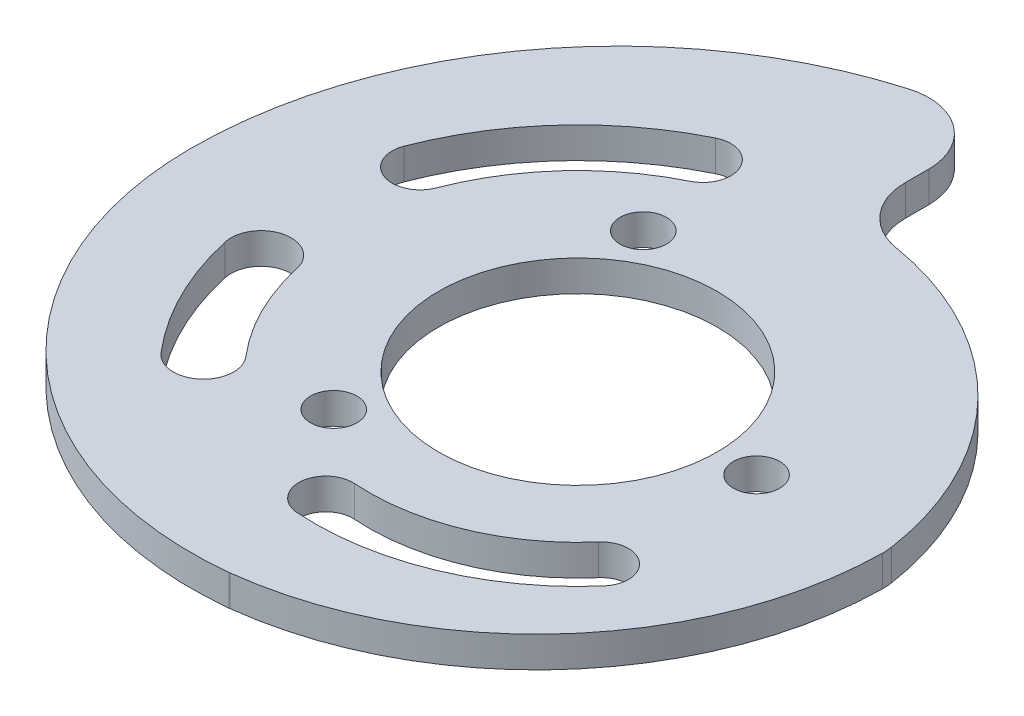
ISO-10303-21;
HEADER;
FILE_DESCRIPTION(('STEP AP214'),'2;1');
FILE_NAME('part.step','',(''),(''),'','','');
FILE_SCHEMA(('AUTOMOTIVE_DESIGN { 1 0 10303 214 1 1 1 1 }'));
ENDSEC;
DATA;
#1=APPLICATION_CONTEXT('core data for automotive mechanical design processes');
#2=APPLICATION_PROTOCOL_DEFINITION('international standard','automotive_design',2000,#1);
#3=PRODUCT_CONTEXT('',#1,'mechanical');
#4=PRODUCT('Part','Part','',(#3));
#5=PRODUCT_RELATED_PRODUCT_CATEGORY('part','',(#4));
#6=PRODUCT_DEFINITION_FORMATION('','',#4);
#7=PRODUCT_DEFINITION_CONTEXT('part definition',#1,'design');
#8=PRODUCT_DEFINITION('design','',#6,#7);
#9=PRODUCT_DEFINITION_SHAPE('','',#8);
#10=(LENGTH_UNIT() NAMED_UNIT(*) SI_UNIT(.MILLI.,.METRE.));
#11=(NAMED_UNIT(*) PLANE_ANGLE_UNIT() SI_UNIT($,.RADIAN.));
#12=(NAMED_UNIT(*) SI_UNIT($,.STERADIAN.) SOLID_ANGLE_UNIT());
#13=UNCERTAINTY_MEASURE_WITH_UNIT(LENGTH_MEASURE(1.E-05),#10,'distance_accuracy_value','');
#14=(GEOMETRIC_REPRESENTATION_CONTEXT(3) GLOBAL_UNCERTAINTY_ASSIGNED_CONTEXT((#13)) GLOBAL_UNIT_ASSIGNED_CONTEXT((#10,
#11,#12)) REPRESENTATION_CONTEXT('',''));
#15=CARTESIAN_POINT('',(0.,0.,0.));
#16=DIRECTION('',(0.,0.,1.));
#17=DIRECTION('',(1.,0.,0.));
#18=AXIS2_PLACEMENT_3D('',#15,#16,#17);
#19=CARTESIAN_POINT('',(2.62500000000001,2.,0.));
#20=DIRECTION('',(0.,-1.,0.));
#21=DIRECTION('',(0.,0.,-1.));
#22=AXIS2_PLACEMENT_3D('',#19,#20,#21);
#23=CYLINDRICAL_SURFACE('',#22,27.625);
#24=CARTESIAN_POINT('',(2.62500000000001,2.,0.));
#25=DIRECTION('',(0.,1.,0.));
#26=DIRECTION('',(0.,0.,1.));
#27=AXIS2_PLACEMENT_3D('',#24,#25,#26);
#28=CIRCLE('',#27,27.625);
#29=CARTESIAN_POINT('',(-5.12169312169312,2.,-26.5165867086681));
#30=VERTEX_POINT('',#29);
#31=CARTESIAN_POINT('',(-25.,2.,0.));
#32=VERTEX_POINT('',#31);
#33=EDGE_CURVE('E303',#30,#32,#28,.T.);
#34=ORIENTED_EDGE('',*,*,#33,.F.);
#35=DIRECTION('',(0.,-1.,0.));
#36=VECTOR('',#35,1.);
#37=CARTESIAN_POINT('',(-5.12169312169312,2.,-26.5165867086681));
#38=LINE('',#37,#36);
#39=CARTESIAN_POINT('',(-5.12169312169312,0.,-26.5165867086681));
#40=VERTEX_POINT('',#39);
#41=EDGE_CURVE('E362',#30,#40,#38,.T.);
#42=ORIENTED_EDGE('',*,*,#41,.T.);
#43=CARTESIAN_POINT('',(2.62500000000001,0.,0.));
#44=DIRECTION('',(0.,1.,0.));
#45=DIRECTION('',(0.,0.,1.));
#46=AXIS2_PLACEMENT_3D('',#43,#44,#45);
#47=CIRCLE('',#46,27.625);
#48=CARTESIAN_POINT('',(-25.,0.,0.));
#49=VERTEX_POINT('',#48);
#50=EDGE_CURVE('E300',#40,#49,#47,.T.);
#51=ORIENTED_EDGE('',*,*,#50,.T.);
#52=DIRECTION('',(0.,-1.,0.));
#53=VECTOR('',#52,1.);
#54=CARTESIAN_POINT('',(-25.,2.,0.));
#55=LINE('',#54,#53);
#56=EDGE_CURVE('E318',#32,#49,#55,.T.);
#57=ORIENTED_EDGE('',*,*,#56,.F.);
#58=EDGE_LOOP('',(#34,#42,#51,#57));
#59=FACE_BOUND('',#58,.T.);
#60=ADVANCED_FACE('F35',(#59),#23,.T.);
#61=CARTESIAN_POINT('',(-2.37500000000001,2.,0.));
#62=DIRECTION('',(0.,-1.,0.));
#63=DIRECTION('',(0.,0.,-1.));
#64=AXIS2_PLACEMENT_3D('',#61,#62,#63);
#65=CYLINDRICAL_SURFACE('',#64,22.625);
#66=CARTESIAN_POINT('',(-2.37500000000001,0.,0.));
#67=DIRECTION('',(0.,1.,0.));
#68=DIRECTION('',(0.,0.,1.));
#69=AXIS2_PLACEMENT_3D('',#66,#67,#68);
#70=CIRCLE('',#69,22.625);
#71=CARTESIAN_POINT('',(-0.029828486204325,0.,22.5031285729536));
#72=VERTEX_POINT('',#71);
#73=EDGE_CURVE('E320',#49,#72,#70,.T.);
#74=ORIENTED_EDGE('',*,*,#73,.T.);
#75=DIRECTION('',(0.,-1.,0.));
#76=VECTOR('',#75,1.);
#77=CARTESIAN_POINT('',(-0.0298284862043246,2.,22.5031285729536));
#78=LINE('',#77,#76);
#79=CARTESIAN_POINT('',(-0.029828486204325,2.,22.5031285729536));
#80=VERTEX_POINT('',#79);
#81=EDGE_CURVE('E344',#72,#80,#78,.F.);
#82=ORIENTED_EDGE('',*,*,#81,.T.);
#83=CARTESIAN_POINT('',(-2.37500000000001,2.,0.));
#84=DIRECTION('',(0.,1.,0.));
#85=DIRECTION('',(0.,0.,1.));
#86=AXIS2_PLACEMENT_3D('',#83,#84,#85);
#87=CIRCLE('',#86,22.625);
#88=EDGE_CURVE('E305',#32,#80,#87,.T.);
#89=ORIENTED_EDGE('',*,*,#88,.F.);
#90=ORIENTED_EDGE('',*,*,#56,.T.);
#91=EDGE_LOOP('',(#74,#82,#89,#90));
#92=FACE_BOUND('',#91,.T.);
#93=ADVANCED_FACE('F393',(#92),#65,.T.);
#94=CARTESIAN_POINT('',(-2.65625000000001,2.,0.));
#95=DIRECTION('',(0.,-1.,0.));
#96=DIRECTION('',(0.,0.,-1.));
#97=AXIS2_PLACEMENT_3D('',#94,#95,#96);
#98=CYLINDRICAL_SURFACE('',#97,22.65625);
#99=CARTESIAN_POINT('',(-2.65625000000001,2.,0.));
#100=DIRECTION('',(0.,1.,0.));
#101=DIRECTION('',(0.,0.,1.));
#102=AXIS2_PLACEMENT_3D('',#99,#100,#101);
#103=CIRCLE('',#102,22.65625);
#104=CARTESIAN_POINT('',(0.0297785222408337,2.,22.4964644964539));
#105=VERTEX_POINT('',#104);
#106=CARTESIAN_POINT('',(19.9976520326362,2.,0.326169830338211));
#107=VERTEX_POINT('',#106);
#108=EDGE_CURVE('E309',#105,#107,#103,.T.);
#109=ORIENTED_EDGE('',*,*,#108,.F.);
#110=DIRECTION('',(0.,-1.,0.));
#111=VECTOR('',#110,1.);
#112=CARTESIAN_POINT('',(0.0297785222408337,2.,22.4964644964539));
#113=LINE('',#112,#111);
#114=CARTESIAN_POINT('',(0.0297785222408337,0.,22.4964644964539));
#115=VERTEX_POINT('',#114);
#116=EDGE_CURVE('E335',#105,#115,#113,.T.);
#117=ORIENTED_EDGE('',*,*,#116,.T.);
#118=CARTESIAN_POINT('',(-2.65625000000001,0.,0.));
#119=DIRECTION('',(0.,1.,0.));
#120=DIRECTION('',(0.,0.,1.));
#121=AXIS2_PLACEMENT_3D('',#118,#119,#120);
#122=CIRCLE('',#121,22.65625);
#123=CARTESIAN_POINT('',(19.9976520326362,0.,0.326169830338211));
#124=VERTEX_POINT('',#123);
#125=EDGE_CURVE('E323',#115,#124,#122,.T.);
#126=ORIENTED_EDGE('',*,*,#125,.T.);
#127=DIRECTION('',(0.,-1.,0.));
#128=VECTOR('',#127,1.);
#129=CARTESIAN_POINT('',(19.9976520326362,2.,0.326169830338211));
#130=LINE('',#129,#128);
#131=EDGE_CURVE('E333',#124,#107,#130,.F.);
#132=ORIENTED_EDGE('',*,*,#131,.T.);
#133=EDGE_LOOP('',(#109,#117,#126,#132));
#134=FACE_BOUND('',#133,.T.);
#135=ADVANCED_FACE('F401',(#134),#98,.T.);
#136=CARTESIAN_POINT('',(0.,2.,2.67857142857143));
#137=DIRECTION('',(0.,-1.,0.));
#138=DIRECTION('',(0.,0.,-1.));
#139=AXIS2_PLACEMENT_3D('',#136,#137,#138);
#140=CYLINDRICAL_SURFACE('',#139,20.1785714285714);
#141=CARTESIAN_POINT('',(0.,2.,2.67857142857143));
#142=DIRECTION('',(0.,1.,0.));
#143=DIRECTION('',(0.,0.,1.));
#144=AXIS2_PLACEMENT_3D('',#141,#142,#143);
#145=CIRCLE('',#144,20.1785714285714);
#146=CARTESIAN_POINT('',(19.9534384375987,2.,-0.327262800876213));
#147=VERTEX_POINT('',#146);
#148=CARTESIAN_POINT('',(3.33825701624816,2.,-17.2219508005418));
#149=VERTEX_POINT('',#148);
#150=EDGE_CURVE('E312',#147,#149,#145,.T.);
#151=ORIENTED_EDGE('',*,*,#150,.F.);
#152=DIRECTION('',(0.,-1.,0.));
#153=VECTOR('',#152,1.);
#154=CARTESIAN_POINT('',(19.9534384375987,2.,-0.327262800876212));
#155=LINE('',#154,#153);
#156=CARTESIAN_POINT('',(19.9534384375987,0.,-0.327262800876213));
#157=VERTEX_POINT('',#156);
#158=EDGE_CURVE('E354',#147,#157,#155,.T.);
#159=ORIENTED_EDGE('',*,*,#158,.T.);
#160=CARTESIAN_POINT('',(0.,0.,2.67857142857143));
#161=DIRECTION('',(0.,1.,0.));
#162=DIRECTION('',(0.,0.,1.));
#163=AXIS2_PLACEMENT_3D('',#160,#161,#162);
#164=CIRCLE('',#163,20.1785714285714);
#165=CARTESIAN_POINT('',(3.33825701624816,0.,-17.2219508005418));
#166=VERTEX_POINT('',#165);
#167=EDGE_CURVE('E326',#157,#166,#164,.T.);
#168=ORIENTED_EDGE('',*,*,#167,.T.);
#169=DIRECTION('',(0.,-1.,0.));
#170=VECTOR('',#169,1.);
#171=CARTESIAN_POINT('',(3.33825701624816,2.,-17.2219508005418));
#172=LINE('',#171,#170);
#173=EDGE_CURVE('E352',#166,#149,#172,.F.);
#174=ORIENTED_EDGE('',*,*,#173,.T.);
#175=EDGE_LOOP('',(#151,#159,#168,#174));
#176=FACE_BOUND('',#175,.T.);
#177=ADVANCED_FACE('F373',(#176),#140,.T.);
#178=CARTESIAN_POINT('',(0.,2.,-27.5));
#179=DIRECTION('',(-1.,0.,0.));
#180=DIRECTION('',(0.,0.,1.));
#181=AXIS2_PLACEMENT_3D('',#178,#179,#180);
#182=PLANE('',#181);
#183=DIRECTION('',(0.,0.,-1.));
#184=VECTOR('',#183,1.);
#185=CARTESIAN_POINT('',(0.,2.,-27.5));
#186=LINE('',#185,#184);
#187=CARTESIAN_POINT('',(0.,2.,-21.1668330831271));
#188=VERTEX_POINT('',#187);
#189=CARTESIAN_POINT('',(0.,2.,-22.6770809408971));
#190=VERTEX_POINT('',#189);
#191=EDGE_CURVE('E315',#188,#190,#186,.T.);
#192=ORIENTED_EDGE('',*,*,#191,.F.);
#193=DIRECTION('',(0.,1.,0.));
#194=VECTOR('',#193,1.);
#195=CARTESIAN_POINT('',(0.,0.,-21.1668330831271));
#196=LINE('',#195,#194);
#197=CARTESIAN_POINT('',(0.,0.,-21.1668330831271));
#198=VERTEX_POINT('',#197);
#199=EDGE_CURVE('E359',#188,#198,#196,.F.);
#200=ORIENTED_EDGE('',*,*,#199,.T.);
#201=DIRECTION('',(0.,0.,-1.));
#202=VECTOR('',#201,1.);
#203=CARTESIAN_POINT('',(0.,0.,-27.5));
#204=LINE('',#203,#202);
#205=CARTESIAN_POINT('',(0.,0.,-22.6770809408971));
#206=VERTEX_POINT('',#205);
#207=EDGE_CURVE('E306',#198,#206,#204,.T.);
#208=ORIENTED_EDGE('',*,*,#207,.T.);
#209=DIRECTION('',(0.,-1.,0.));
#210=VECTOR('',#209,1.);
#211=CARTESIAN_POINT('',(0.,2.,-22.6770809408971));
#212=LINE('',#211,#210);
#213=EDGE_CURVE('E357',#206,#190,#212,.F.);
#214=ORIENTED_EDGE('',*,*,#213,.T.);
#215=EDGE_LOOP('',(#192,#200,#208,#214));
#216=FACE_BOUND('',#215,.T.);
#217=ADVANCED_FACE('F382',(#216),#182,.F.);
#218=CARTESIAN_POINT('',(2.62500000000001,2.,0.));
#219=DIRECTION('',(0.,1.,0.));
#220=DIRECTION('',(0.,0.,1.));
#221=AXIS2_PLACEMENT_3D('',#218,#219,#220);
#222=PLANE('',#221);
#223=CARTESIAN_POINT('',(-7.82872122040298,2.,-15.9036735924259));
#224=DIRECTION('',(0.,1.,0.));
#225=DIRECTION('',(0.,0.,1.));
#226=AXIS2_PLACEMENT_3D('',#223,#224,#225);
#227=CIRCLE('',#226,1.80810399630785);
#228=CARTESIAN_POINT('',(-7.03017457973003,2.,-14.2814641965295));
#229=VERTEX_POINT('',#228);
#230=CARTESIAN_POINT('',(-8.62726786107593,2.,-17.5258829883222));
#231=VERTEX_POINT('',#230);
#232=EDGE_CURVE('E50',#229,#231,#227,.T.);
#233=ORIENTED_EDGE('',*,*,#232,.F.);
#234=CARTESIAN_POINT('',(0.,2.,0.));
#235=DIRECTION('',(0.,-1.,0.));
#236=DIRECTION('',(0.,0.,1.));
#237=AXIS2_PLACEMENT_3D('',#234,#235,#236);
#238=CIRCLE('',#237,15.9180267061667);
#239=CARTESIAN_POINT('',(-14.8598544786485,2.,-5.70686420826937));
#240=VERTEX_POINT('',#239);
#241=EDGE_CURVE('E222',#240,#229,#238,.T.);
#242=ORIENTED_EDGE('',*,*,#241,.F.);
#243=CARTESIAN_POINT('',(-16.5477623307562,2.,-6.35509807367435));
#244=DIRECTION('',(0.,1.,0.));
#245=DIRECTION('',(0.,0.,1.));
#246=AXIS2_PLACEMENT_3D('',#243,#244,#245);
#247=CIRCLE('',#246,1.80810399630785);
#248=CARTESIAN_POINT('',(-18.2356701828638,2.,-7.00333193907932));
#249=VERTEX_POINT('',#248);
#250=EDGE_CURVE('E236',#249,#240,#247,.T.);
#251=ORIENTED_EDGE('',*,*,#250,.F.);
#252=CARTESIAN_POINT('',(0.,2.,0.));
#253=DIRECTION('',(0.,1.,0.));
#254=DIRECTION('',(0.,0.,1.));
#255=AXIS2_PLACEMENT_3D('',#252,#253,#254);
#256=CIRCLE('',#255,19.5342346987824);
#257=EDGE_CURVE('E233',#231,#249,#256,.T.);
#258=ORIENTED_EDGE('',*,*,#257,.F.);
#259=EDGE_LOOP('',(#233,#242,#251,#258));
#260=FACE_BOUND('',#259,.T.);
#261=CARTESIAN_POINT('',(-1.06882977301814,2.,15.217698537683));
#262=DIRECTION('',(0.,1.,0.));
#263=DIRECTION('',(0.,0.,1.));
#264=AXIS2_PLACEMENT_3D('',#261,#262,#263);
#265=CIRCLE('',#264,1.74428462531505);
#266=CARTESIAN_POINT('',(-0.946619322355121,2.,13.4777004170348));
#267=VERTEX_POINT('',#266);
#268=CARTESIAN_POINT('',(-1.19104022368119,2.,16.9576966583311));
#269=VERTEX_POINT('',#268);
#270=EDGE_CURVE('E58',#267,#269,#265,.T.);
#271=ORIENTED_EDGE('',*,*,#270,.F.);
#272=CARTESIAN_POINT('',(0.,2.,0.));
#273=DIRECTION('',(0.,-1.,0.));
#274=DIRECTION('',(0.,0.,1.));
#275=AXIS2_PLACEMENT_3D('',#272,#273,#274);
#276=CIRCLE('',#275,13.5109028814804);
#277=CARTESIAN_POINT('',(10.2034150943967,2.,8.85634332465906));
#278=VERTEX_POINT('',#277);
#279=EDGE_CURVE('E198',#278,#267,#276,.T.);
#280=ORIENTED_EDGE('',*,*,#279,.F.);
#281=CARTESIAN_POINT('',(11.5206964212619,2.,9.99971498776894));
#282=DIRECTION('',(0.,1.,0.));
#283=DIRECTION('',(0.,0.,1.));
#284=AXIS2_PLACEMENT_3D('',#281,#282,#283);
#285=CIRCLE('',#284,1.74428462531505);
#286=CARTESIAN_POINT('',(12.8379777481272,2.,11.1430866508788));
#287=VERTEX_POINT('',#286);
#288=EDGE_CURVE('E201',#287,#278,#285,.T.);
#289=ORIENTED_EDGE('',*,*,#288,.F.);
#290=CARTESIAN_POINT('',(0.,2.,0.));
#291=DIRECTION('',(0.,1.,0.));
#292=DIRECTION('',(0.,0.,1.));
#293=AXIS2_PLACEMENT_3D('',#290,#291,#292);
#294=CIRCLE('',#293,16.9994721321105);
#295=EDGE_CURVE('E207',#269,#287,#294,.T.);
#296=ORIENTED_EDGE('',*,*,#295,.F.);
#297=EDGE_LOOP('',(#271,#280,#289,#296));
#298=FACE_BOUND('',#297,.T.);
#299=CARTESIAN_POINT('',(-16.7538171658898,2.,3.71221615336309));
#300=DIRECTION('',(0.,1.,0.));
#301=DIRECTION('',(0.,0.,1.));
#302=AXIS2_PLACEMENT_3D('',#299,#300,#301);
#303=CIRCLE('',#302,1.9439985558828);
#304=CARTESIAN_POINT('',(-14.8558508982296,2.,3.2916755107392));
#305=VERTEX_POINT('',#304);
#306=CARTESIAN_POINT('',(-18.65178343355,2.,4.13275679598697));
#307=VERTEX_POINT('',#306);
#308=EDGE_CURVE('E214',#305,#307,#303,.T.);
#309=ORIENTED_EDGE('',*,*,#308,.F.);
#310=CARTESIAN_POINT('',(0.,2.,0.));
#311=DIRECTION('',(0.,-1.,0.));
#312=DIRECTION('',(0.,0.,1.));
#313=AXIS2_PLACEMENT_3D('',#310,#311,#312);
#314=CIRCLE('',#313,15.2161569911207);
#315=CARTESIAN_POINT('',(-11.5716248708824,2.,9.88073536868615));
#316=VERTEX_POINT('',#315);
#317=EDGE_CURVE('E251',#316,#305,#314,.T.);
#318=ORIENTED_EDGE('',*,*,#317,.F.);
#319=CARTESIAN_POINT('',(-13.0500022332703,2.,11.1430866508788));
#320=DIRECTION('',(0.,1.,0.));
#321=DIRECTION('',(0.,0.,1.));
#322=AXIS2_PLACEMENT_3D('',#319,#320,#321);
#323=CIRCLE('',#322,1.9439985558828);
#324=CARTESIAN_POINT('',(-14.5283795956582,2.,12.4054379330715));
#325=VERTEX_POINT('',#324);
#326=EDGE_CURVE('E265',#325,#316,#323,.T.);
#327=ORIENTED_EDGE('',*,*,#326,.F.);
#328=CARTESIAN_POINT('',(0.,2.,0.));
#329=DIRECTION('',(0.,1.,0.));
#330=DIRECTION('',(0.,0.,1.));
#331=AXIS2_PLACEMENT_3D('',#328,#329,#330);
#332=CIRCLE('',#331,19.1041541028863);
#333=EDGE_CURVE('E262',#307,#325,#332,.T.);
#334=ORIENTED_EDGE('',*,*,#333,.F.);
#335=EDGE_LOOP('',(#309,#318,#327,#334));
#336=FACE_BOUND('',#335,.T.);
#337=CARTESIAN_POINT('',(11.5470053837925,2.,0.));
#338=DIRECTION('',(0.,1.,0.));
#339=DIRECTION('',(0.,0.,1.));
#340=AXIS2_PLACEMENT_3D('',#337,#338,#339);
#341=CIRCLE('',#340,1.5);
#342=CARTESIAN_POINT('',(11.5470053837925,2.,1.5));
#343=VERTEX_POINT('',#342);
#344=EDGE_CURVE('E283',#343,#343,#341,.T.);
#345=ORIENTED_EDGE('',*,*,#344,.F.);
#346=EDGE_LOOP('',(#345));
#347=FACE_BOUND('',#346,.T.);
#348=CARTESIAN_POINT('',(-5.77350269189626,2.,-10.));
#349=DIRECTION('',(0.,1.,0.));
#350=DIRECTION('',(0.,0.,1.));
#351=AXIS2_PLACEMENT_3D('',#348,#349,#350);
#352=CIRCLE('',#351,1.5);
#353=CARTESIAN_POINT('',(-5.77350269189626,2.,-8.5));
#354=VERTEX_POINT('',#353);
#355=EDGE_CURVE('E289',#354,#354,#352,.T.);
#356=ORIENTED_EDGE('',*,*,#355,.F.);
#357=EDGE_LOOP('',(#356));
#358=FACE_BOUND('',#357,.T.);
#359=CARTESIAN_POINT('',(-5.77350269189626,2.,10.));
#360=DIRECTION('',(0.,1.,0.));
#361=DIRECTION('',(0.,0.,1.));
#362=AXIS2_PLACEMENT_3D('',#359,#360,#361);
#363=CIRCLE('',#362,1.5);
#364=CARTESIAN_POINT('',(-5.77350269189626,2.,11.5));
#365=VERTEX_POINT('',#364);
#366=EDGE_CURVE('E272',#365,#365,#363,.T.);
#367=ORIENTED_EDGE('',*,*,#366,.F.);
#368=EDGE_LOOP('',(#367));
#369=FACE_BOUND('',#368,.T.);
#370=CARTESIAN_POINT('',(0.,2.,0.));
#371=DIRECTION('',(0.,1.,0.));
#372=DIRECTION('',(0.,0.,1.));
#373=AXIS2_PLACEMENT_3D('',#370,#371,#372);
#374=CIRCLE('',#373,9.);
#375=CARTESIAN_POINT('',(0.,2.,9.));
#376=VERTEX_POINT('',#375);
#377=EDGE_CURVE('E282',#376,#376,#374,.T.);
#378=ORIENTED_EDGE('',*,*,#377,.F.);
#379=EDGE_LOOP('',(#378));
#380=FACE_BOUND('',#379,.T.);
#381=ORIENTED_EDGE('',*,*,#88,.T.);
#382=CARTESIAN_POINT('',(-0.444444444444445,2.,18.5246749025972));
#383=DIRECTION('',(0.,1.,0.));
#384=DIRECTION('',(0.,0.,1.));
#385=AXIS2_PLACEMENT_3D('',#382,#383,#384);
#386=CIRCLE('',#385,4.);
#387=EDGE_CURVE('E350',#80,#105,#386,.T.);
#388=ORIENTED_EDGE('',*,*,#387,.T.);
#389=ORIENTED_EDGE('',*,*,#108,.T.);
#390=CARTESIAN_POINT('',(15.9980665703225,2.,0.268583984430222));
#391=DIRECTION('',(0.,1.,0.));
#392=DIRECTION('',(0.,0.,1.));
#393=AXIS2_PLACEMENT_3D('',#390,#391,#392);
#394=CIRCLE('',#393,4.);
#395=EDGE_CURVE('E348',#107,#147,#394,.T.);
#396=ORIENTED_EDGE('',*,*,#395,.T.);
#397=ORIENTED_EDGE('',*,*,#150,.T.);
#398=CARTESIAN_POINT('',(4.,2.,-21.1668330831271));
#399=DIRECTION('',(0.,1.,0.));
#400=DIRECTION('',(0.,0.,1.));
#401=AXIS2_PLACEMENT_3D('',#398,#399,#400);
#402=CIRCLE('',#401,4.);
#403=EDGE_CURVE('E11',#149,#188,#402,.F.);
#404=ORIENTED_EDGE('',*,*,#403,.T.);
#405=ORIENTED_EDGE('',*,*,#191,.T.);
#406=CARTESIAN_POINT('',(-4.,2.,-22.6770809408971));
#407=DIRECTION('',(0.,1.,0.));
#408=DIRECTION('',(0.,0.,1.));
#409=AXIS2_PLACEMENT_3D('',#406,#407,#408);
#410=CIRCLE('',#409,4.);
#411=EDGE_CURVE('E346',#190,#30,#410,.T.);
#412=ORIENTED_EDGE('',*,*,#411,.T.);
#413=ORIENTED_EDGE('',*,*,#33,.T.);
#414=EDGE_LOOP('',(#381,#388,#389,#396,#397,#404,#405,#412,#413));
#415=FACE_BOUND('',#414,.T.);
#416=ADVANCED_FACE('F379',(#260,#298,#336,#347,#358,#369,#380,#415),#222,.T.);
#417=CARTESIAN_POINT('',(2.62500000000001,0.,0.));
#418=DIRECTION('',(0.,1.,0.));
#419=DIRECTION('',(0.,0.,1.));
#420=AXIS2_PLACEMENT_3D('',#417,#418,#419);
#421=PLANE('',#420);
#422=CARTESIAN_POINT('',(0.,0.,0.));
#423=DIRECTION('',(0.,-1.,0.));
#424=DIRECTION('',(0.,0.,1.));
#425=AXIS2_PLACEMENT_3D('',#422,#423,#424);
#426=CIRCLE('',#425,15.9180267061667);
#427=CARTESIAN_POINT('',(-14.8598544786485,0.,-5.70686420826937));
#428=VERTEX_POINT('',#427);
#429=CARTESIAN_POINT('',(-7.03017457973003,0.,-14.2814641965295));
#430=VERTEX_POINT('',#429);
#431=EDGE_CURVE('E228',#428,#430,#426,.T.);
#432=ORIENTED_EDGE('',*,*,#431,.T.);
#433=CARTESIAN_POINT('',(-7.82872122040298,0.,-15.9036735924259));
#434=DIRECTION('',(0.,1.,0.));
#435=DIRECTION('',(0.,0.,1.));
#436=AXIS2_PLACEMENT_3D('',#433,#434,#435);
#437=CIRCLE('',#436,1.80810399630785);
#438=CARTESIAN_POINT('',(-8.62726786107593,0.,-17.5258829883222));
#439=VERTEX_POINT('',#438);
#440=EDGE_CURVE('E218',#430,#439,#437,.T.);
#441=ORIENTED_EDGE('',*,*,#440,.T.);
#442=CARTESIAN_POINT('',(0.,0.,0.));
#443=DIRECTION('',(0.,1.,0.));
#444=DIRECTION('',(0.,0.,1.));
#445=AXIS2_PLACEMENT_3D('',#442,#443,#444);
#446=CIRCLE('',#445,19.5342346987824);
#447=CARTESIAN_POINT('',(-18.2356701828638,0.,-7.00333193907932));
#448=VERTEX_POINT('',#447);
#449=EDGE_CURVE('E221',#439,#448,#446,.T.);
#450=ORIENTED_EDGE('',*,*,#449,.T.);
#451=CARTESIAN_POINT('',(-16.5477623307562,0.,-6.35509807367435));
#452=DIRECTION('',(0.,1.,0.));
#453=DIRECTION('',(0.,0.,1.));
#454=AXIS2_PLACEMENT_3D('',#451,#452,#453);
#455=CIRCLE('',#454,1.80810399630785);
#456=EDGE_CURVE('E225',#448,#428,#455,.T.);
#457=ORIENTED_EDGE('',*,*,#456,.T.);
#458=EDGE_LOOP('',(#432,#441,#450,#457));
#459=FACE_BOUND('',#458,.T.);
#460=CARTESIAN_POINT('',(0.,0.,0.));
#461=DIRECTION('',(0.,-1.,0.));
#462=DIRECTION('',(0.,0.,1.));
#463=AXIS2_PLACEMENT_3D('',#460,#461,#462);
#464=CIRCLE('',#463,13.5109028814804);
#465=CARTESIAN_POINT('',(10.2034150943967,0.,8.85634332465906));
#466=VERTEX_POINT('',#465);
#467=CARTESIAN_POINT('',(-0.946619322355121,0.,13.4777004170348));
#468=VERTEX_POINT('',#467);
#469=EDGE_CURVE('E185',#466,#468,#464,.T.);
#470=ORIENTED_EDGE('',*,*,#469,.T.);
#471=CARTESIAN_POINT('',(-1.06882977301814,0.,15.217698537683));
#472=DIRECTION('',(0.,1.,0.));
#473=DIRECTION('',(0.,0.,1.));
#474=AXIS2_PLACEMENT_3D('',#471,#472,#473);
#475=CIRCLE('',#474,1.74428462531505);
#476=CARTESIAN_POINT('',(-1.19104022368119,0.,16.9576966583311));
#477=VERTEX_POINT('',#476);
#478=EDGE_CURVE('E179',#468,#477,#475,.T.);
#479=ORIENTED_EDGE('',*,*,#478,.T.);
#480=CARTESIAN_POINT('',(0.,0.,0.));
#481=DIRECTION('',(0.,1.,0.));
#482=DIRECTION('',(0.,0.,1.));
#483=AXIS2_PLACEMENT_3D('',#480,#481,#482);
#484=CIRCLE('',#483,16.9994721321105);
#485=CARTESIAN_POINT('',(12.8379777481272,0.,11.1430866508788));
#486=VERTEX_POINT('',#485);
#487=EDGE_CURVE('E189',#477,#486,#484,.T.);
#488=ORIENTED_EDGE('',*,*,#487,.T.);
#489=CARTESIAN_POINT('',(11.5206964212619,0.,9.99971498776894));
#490=DIRECTION('',(0.,1.,0.));
#491=DIRECTION('',(0.,0.,1.));
#492=AXIS2_PLACEMENT_3D('',#489,#490,#491);
#493=CIRCLE('',#492,1.74428462531505);
#494=EDGE_CURVE('E193',#486,#466,#493,.T.);
#495=ORIENTED_EDGE('',*,*,#494,.T.);
#496=EDGE_LOOP('',(#470,#479,#488,#495));
#497=FACE_BOUND('',#496,.T.);
#498=CARTESIAN_POINT('',(0.,0.,0.));
#499=DIRECTION('',(0.,-1.,0.));
#500=DIRECTION('',(0.,0.,1.));
#501=AXIS2_PLACEMENT_3D('',#498,#499,#500);
#502=CIRCLE('',#501,15.2161569911207);
#503=CARTESIAN_POINT('',(-11.5716248708824,0.,9.88073536868615));
#504=VERTEX_POINT('',#503);
#505=CARTESIAN_POINT('',(-14.8558508982296,0.,3.2916755107392));
#506=VERTEX_POINT('',#505);
#507=EDGE_CURVE('E257',#504,#506,#502,.T.);
#508=ORIENTED_EDGE('',*,*,#507,.T.);
#509=CARTESIAN_POINT('',(-16.7538171658898,0.,3.71221615336309));
#510=DIRECTION('',(0.,1.,0.));
#511=DIRECTION('',(0.,0.,1.));
#512=AXIS2_PLACEMENT_3D('',#509,#510,#511);
#513=CIRCLE('',#512,1.9439985558828);
#514=CARTESIAN_POINT('',(-18.65178343355,0.,4.13275679598697));
#515=VERTEX_POINT('',#514);
#516=EDGE_CURVE('E247',#506,#515,#513,.T.);
#517=ORIENTED_EDGE('',*,*,#516,.T.);
#518=CARTESIAN_POINT('',(0.,0.,0.));
#519=DIRECTION('',(0.,1.,0.));
#520=DIRECTION('',(0.,0.,1.));
#521=AXIS2_PLACEMENT_3D('',#518,#519,#520);
#522=CIRCLE('',#521,19.1041541028863);
#523=CARTESIAN_POINT('',(-14.5283795956582,0.,12.4054379330715));
#524=VERTEX_POINT('',#523);
#525=EDGE_CURVE('E250',#515,#524,#522,.T.);
#526=ORIENTED_EDGE('',*,*,#525,.T.);
#527=CARTESIAN_POINT('',(-13.0500022332703,0.,11.1430866508788));
#528=DIRECTION('',(0.,1.,0.));
#529=DIRECTION('',(0.,0.,1.));
#530=AXIS2_PLACEMENT_3D('',#527,#528,#529);
#531=CIRCLE('',#530,1.9439985558828);
#532=EDGE_CURVE('E254',#524,#504,#531,.T.);
#533=ORIENTED_EDGE('',*,*,#532,.T.);
#534=EDGE_LOOP('',(#508,#517,#526,#533));
#535=FACE_BOUND('',#534,.T.);
#536=CARTESIAN_POINT('',(11.5470053837925,0.,0.));
#537=DIRECTION('',(0.,1.,0.));
#538=DIRECTION('',(0.,0.,1.));
#539=AXIS2_PLACEMENT_3D('',#536,#537,#538);
#540=CIRCLE('',#539,1.5);
#541=CARTESIAN_POINT('',(11.5470053837925,0.,1.5));
#542=VERTEX_POINT('',#541);
#543=EDGE_CURVE('E279',#542,#542,#540,.T.);
#544=ORIENTED_EDGE('',*,*,#543,.T.);
#545=EDGE_LOOP('',(#544));
#546=FACE_BOUND('',#545,.T.);
#547=CARTESIAN_POINT('',(-5.77350269189626,0.,-10.));
#548=DIRECTION('',(0.,1.,0.));
#549=DIRECTION('',(0.,0.,1.));
#550=AXIS2_PLACEMENT_3D('',#547,#548,#549);
#551=CIRCLE('',#550,1.5);
#552=CARTESIAN_POINT('',(-5.77350269189626,0.,-8.5));
#553=VERTEX_POINT('',#552);
#554=EDGE_CURVE('E286',#553,#553,#551,.T.);
#555=ORIENTED_EDGE('',*,*,#554,.T.);
#556=EDGE_LOOP('',(#555));
#557=FACE_BOUND('',#556,.T.);
#558=CARTESIAN_POINT('',(-5.77350269189626,0.,10.));
#559=DIRECTION('',(0.,1.,0.));
#560=DIRECTION('',(0.,0.,1.));
#561=AXIS2_PLACEMENT_3D('',#558,#559,#560);
#562=CIRCLE('',#561,1.5);
#563=CARTESIAN_POINT('',(-5.77350269189626,0.,11.5));
#564=VERTEX_POINT('',#563);
#565=EDGE_CURVE('E292',#564,#564,#562,.T.);
#566=ORIENTED_EDGE('',*,*,#565,.T.);
#567=EDGE_LOOP('',(#566));
#568=FACE_BOUND('',#567,.T.);
#569=CARTESIAN_POINT('',(0.,0.,0.));
#570=DIRECTION('',(0.,1.,0.));
#571=DIRECTION('',(0.,0.,1.));
#572=AXIS2_PLACEMENT_3D('',#569,#570,#571);
#573=CIRCLE('',#572,9.);
#574=CARTESIAN_POINT('',(0.,0.,9.));
#575=VERTEX_POINT('',#574);
#576=EDGE_CURVE('E297',#575,#575,#573,.T.);
#577=ORIENTED_EDGE('',*,*,#576,.T.);
#578=EDGE_LOOP('',(#577));
#579=FACE_BOUND('',#578,.T.);
#580=ORIENTED_EDGE('',*,*,#125,.F.);
#581=CARTESIAN_POINT('',(-0.444444444444445,0.,18.5246749025972));
#582=DIRECTION('',(0.,1.,0.));
#583=DIRECTION('',(0.,0.,1.));
#584=AXIS2_PLACEMENT_3D('',#581,#582,#583);
#585=CIRCLE('',#584,4.);
#586=EDGE_CURVE('E342',#115,#72,#585,.F.);
#587=ORIENTED_EDGE('',*,*,#586,.T.);
#588=ORIENTED_EDGE('',*,*,#73,.F.);
#589=ORIENTED_EDGE('',*,*,#50,.F.);
#590=CARTESIAN_POINT('',(-4.,0.,-22.6770809408971));
#591=DIRECTION('',(0.,1.,0.));
#592=DIRECTION('',(0.,0.,1.));
#593=AXIS2_PLACEMENT_3D('',#590,#591,#592);
#594=CIRCLE('',#593,4.);
#595=EDGE_CURVE('E338',#40,#206,#594,.F.);
#596=ORIENTED_EDGE('',*,*,#595,.T.);
#597=ORIENTED_EDGE('',*,*,#207,.F.);
#598=CARTESIAN_POINT('',(4.,0.,-21.1668330831271));
#599=DIRECTION('',(0.,1.,0.));
#600=DIRECTION('',(0.,0.,1.));
#601=AXIS2_PLACEMENT_3D('',#598,#599,#600);
#602=CIRCLE('',#601,4.);
#603=EDGE_CURVE('E43',#198,#166,#602,.T.);
#604=ORIENTED_EDGE('',*,*,#603,.T.);
#605=ORIENTED_EDGE('',*,*,#167,.F.);
#606=CARTESIAN_POINT('',(15.9980665703225,0.,0.268583984430222));
#607=DIRECTION('',(0.,1.,0.));
#608=DIRECTION('',(0.,0.,1.));
#609=AXIS2_PLACEMENT_3D('',#606,#607,#608);
#610=CIRCLE('',#609,4.);
#611=EDGE_CURVE('E340',#157,#124,#610,.F.);
#612=ORIENTED_EDGE('',*,*,#611,.T.);
#613=EDGE_LOOP('',(#580,#587,#588,#589,#596,#597,#604,#605,#612));
#614=FACE_BOUND('',#613,.T.);
#615=ADVANCED_FACE('F195',(#459,#497,#535,#546,#557,#568,#579,#614),#421,.F.);
#616=CARTESIAN_POINT('',(0.,0.,0.));
#617=DIRECTION('',(0.,1.,0.));
#618=DIRECTION('',(0.,0.,1.));
#619=AXIS2_PLACEMENT_3D('',#616,#617,#618);
#620=CYLINDRICAL_SURFACE('',#619,9.);
#621=ORIENTED_EDGE('',*,*,#576,.F.);
#622=EDGE_LOOP('',(#621));
#623=FACE_BOUND('',#622,.T.);
#624=ORIENTED_EDGE('',*,*,#377,.T.);
#625=EDGE_LOOP('',(#624));
#626=FACE_BOUND('',#625,.T.);
#627=ADVANCED_FACE('F412',(#623,#626),#620,.F.);
#628=CARTESIAN_POINT('',(-0.444444444444445,2.,18.5246749025972));
#629=DIRECTION('',(0.,-1.,0.));
#630=DIRECTION('',(0.,0.,-1.));
#631=AXIS2_PLACEMENT_3D('',#628,#629,#630);
#632=CYLINDRICAL_SURFACE('',#631,4.);
#633=ORIENTED_EDGE('',*,*,#387,.F.);
#634=ORIENTED_EDGE('',*,*,#81,.F.);
#635=ORIENTED_EDGE('',*,*,#586,.F.);
#636=ORIENTED_EDGE('',*,*,#116,.F.);
#637=EDGE_LOOP('',(#633,#634,#635,#636));
#638=FACE_BOUND('',#637,.T.);
#639=ADVANCED_FACE('F399',(#638),#632,.T.);
#640=CARTESIAN_POINT('',(15.9980665703225,2.,0.268583984430222));
#641=DIRECTION('',(0.,-1.,0.));
#642=DIRECTION('',(0.,0.,-1.));
#643=AXIS2_PLACEMENT_3D('',#640,#641,#642);
#644=CYLINDRICAL_SURFACE('',#643,4.);
#645=ORIENTED_EDGE('',*,*,#395,.F.);
#646=ORIENTED_EDGE('',*,*,#131,.F.);
#647=ORIENTED_EDGE('',*,*,#611,.F.);
#648=ORIENTED_EDGE('',*,*,#158,.F.);
#649=EDGE_LOOP('',(#645,#646,#647,#648));
#650=FACE_BOUND('',#649,.T.);
#651=ADVANCED_FACE('F405',(#650),#644,.T.);
#652=CARTESIAN_POINT('',(4.,2.,-21.1668330831271));
#653=DIRECTION('',(0.,-1.,0.));
#654=DIRECTION('',(0.,0.,-1.));
#655=AXIS2_PLACEMENT_3D('',#652,#653,#654);
#656=CYLINDRICAL_SURFACE('',#655,4.);
#657=ORIENTED_EDGE('',*,*,#403,.F.);
#658=ORIENTED_EDGE('',*,*,#173,.F.);
#659=ORIENTED_EDGE('',*,*,#603,.F.);
#660=ORIENTED_EDGE('',*,*,#199,.F.);
#661=EDGE_LOOP('',(#657,#658,#659,#660));
#662=FACE_BOUND('',#661,.T.);
#663=ADVANCED_FACE('F376',(#662),#656,.F.);
#664=CARTESIAN_POINT('',(-4.,2.,-22.6770809408971));
#665=DIRECTION('',(0.,-1.,0.));
#666=DIRECTION('',(0.,0.,-1.));
#667=AXIS2_PLACEMENT_3D('',#664,#665,#666);
#668=CYLINDRICAL_SURFACE('',#667,4.);
#669=ORIENTED_EDGE('',*,*,#411,.F.);
#670=ORIENTED_EDGE('',*,*,#213,.F.);
#671=ORIENTED_EDGE('',*,*,#595,.F.);
#672=ORIENTED_EDGE('',*,*,#41,.F.);
#673=EDGE_LOOP('',(#669,#670,#671,#672));
#674=FACE_BOUND('',#673,.T.);
#675=ADVANCED_FACE('F37',(#674),#668,.T.);
#676=CARTESIAN_POINT('',(-5.77350269189626,0.,10.));
#677=DIRECTION('',(0.,1.,0.));
#678=DIRECTION('',(0.,0.,1.));
#679=AXIS2_PLACEMENT_3D('',#676,#677,#678);
#680=CYLINDRICAL_SURFACE('',#679,1.5);
#681=ORIENTED_EDGE('',*,*,#565,.F.);
#682=EDGE_LOOP('',(#681));
#683=FACE_BOUND('',#682,.T.);
#684=ORIENTED_EDGE('',*,*,#366,.T.);
#685=EDGE_LOOP('',(#684));
#686=FACE_BOUND('',#685,.T.);
#687=ADVANCED_FACE('F436',(#683,#686),#680,.F.);
#688=CARTESIAN_POINT('',(-5.77350269189626,0.,-10.));
#689=DIRECTION('',(0.,1.,0.));
#690=DIRECTION('',(0.,0.,1.));
#691=AXIS2_PLACEMENT_3D('',#688,#689,#690);
#692=CYLINDRICAL_SURFACE('',#691,1.5);
#693=ORIENTED_EDGE('',*,*,#554,.F.);
#694=EDGE_LOOP('',(#693));
#695=FACE_BOUND('',#694,.T.);
#696=ORIENTED_EDGE('',*,*,#355,.T.);
#697=EDGE_LOOP('',(#696));
#698=FACE_BOUND('',#697,.T.);
#699=ADVANCED_FACE('F439',(#695,#698),#692,.F.);
#700=CARTESIAN_POINT('',(11.5470053837925,0.,0.));
#701=DIRECTION('',(0.,1.,0.));
#702=DIRECTION('',(0.,0.,1.));
#703=AXIS2_PLACEMENT_3D('',#700,#701,#702);
#704=CYLINDRICAL_SURFACE('',#703,1.5);
#705=ORIENTED_EDGE('',*,*,#543,.F.);
#706=EDGE_LOOP('',(#705));
#707=FACE_BOUND('',#706,.T.);
#708=ORIENTED_EDGE('',*,*,#344,.T.);
#709=EDGE_LOOP('',(#708));
#710=FACE_BOUND('',#709,.T.);
#711=ADVANCED_FACE('F443',(#707,#710),#704,.F.);
#712=CARTESIAN_POINT('',(-16.7538171658898,0.,3.71221615336309));
#713=DIRECTION('',(0.,1.,0.));
#714=DIRECTION('',(0.,0.,1.));
#715=AXIS2_PLACEMENT_3D('',#712,#713,#714);
#716=CYLINDRICAL_SURFACE('',#715,1.9439985558828);
#717=ORIENTED_EDGE('',*,*,#308,.T.);
#718=DIRECTION('',(0.,1.,0.));
#719=VECTOR('',#718,1.);
#720=CARTESIAN_POINT('',(-18.65178343355,0.,4.13275679598697));
#721=LINE('',#720,#719);
#722=EDGE_CURVE('E260',#515,#307,#721,.T.);
#723=ORIENTED_EDGE('',*,*,#722,.F.);
#724=ORIENTED_EDGE('',*,*,#516,.F.);
#725=DIRECTION('',(0.,1.,0.));
#726=VECTOR('',#725,1.);
#727=CARTESIAN_POINT('',(-14.8558508982296,0.,3.2916755107392));
#728=LINE('',#727,#726);
#729=EDGE_CURVE('E270',#506,#305,#728,.T.);
#730=ORIENTED_EDGE('',*,*,#729,.T.);
#731=EDGE_LOOP('',(#717,#723,#724,#730));
#732=FACE_BOUND('',#731,.T.);
#733=ADVANCED_FACE('F447',(#732),#716,.F.);
#734=CARTESIAN_POINT('',(0.,0.,0.));
#735=DIRECTION('',(0.,1.,0.));
#736=DIRECTION('',(0.,0.,1.));
#737=AXIS2_PLACEMENT_3D('',#734,#735,#736);
#738=CYLINDRICAL_SURFACE('',#737,15.2161569911207);
#739=ORIENTED_EDGE('',*,*,#317,.T.);
#740=ORIENTED_EDGE('',*,*,#729,.F.);
#741=ORIENTED_EDGE('',*,*,#507,.F.);
#742=DIRECTION('',(0.,1.,0.));
#743=VECTOR('',#742,1.);
#744=CARTESIAN_POINT('',(-11.5716248708824,0.,9.88073536868615));
#745=LINE('',#744,#743);
#746=EDGE_CURVE('E273',#504,#316,#745,.T.);
#747=ORIENTED_EDGE('',*,*,#746,.T.);
#748=EDGE_LOOP('',(#739,#740,#741,#747));
#749=FACE_BOUND('',#748,.T.);
#750=ADVANCED_FACE('F451',(#749),#738,.T.);
#751=CARTESIAN_POINT('',(-13.0500022332703,0.,11.1430866508788));
#752=DIRECTION('',(0.,1.,0.));
#753=DIRECTION('',(0.,0.,1.));
#754=AXIS2_PLACEMENT_3D('',#751,#752,#753);
#755=CYLINDRICAL_SURFACE('',#754,1.9439985558828);
#756=ORIENTED_EDGE('',*,*,#326,.T.);
#757=ORIENTED_EDGE('',*,*,#746,.F.);
#758=ORIENTED_EDGE('',*,*,#532,.F.);
#759=DIRECTION('',(0.,1.,0.));
#760=VECTOR('',#759,1.);
#761=CARTESIAN_POINT('',(-14.5283795956582,0.,12.4054379330715));
#762=LINE('',#761,#760);
#763=EDGE_CURVE('E275',#524,#325,#762,.T.);
#764=ORIENTED_EDGE('',*,*,#763,.T.);
#765=EDGE_LOOP('',(#756,#757,#758,#764));
#766=FACE_BOUND('',#765,.T.);
#767=ADVANCED_FACE('F456',(#766),#755,.F.);
#768=CARTESIAN_POINT('',(0.,0.,0.));
#769=DIRECTION('',(0.,1.,0.));
#770=DIRECTION('',(0.,0.,1.));
#771=AXIS2_PLACEMENT_3D('',#768,#769,#770);
#772=CYLINDRICAL_SURFACE('',#771,19.1041541028863);
#773=ORIENTED_EDGE('',*,*,#333,.T.);
#774=ORIENTED_EDGE('',*,*,#763,.F.);
#775=ORIENTED_EDGE('',*,*,#525,.F.);
#776=ORIENTED_EDGE('',*,*,#722,.T.);
#777=EDGE_LOOP('',(#773,#774,#775,#776));
#778=FACE_BOUND('',#777,.T.);
#779=ADVANCED_FACE('F453',(#778),#772,.F.);
#780=CARTESIAN_POINT('',(-1.06882977301814,0.,15.217698537683));
#781=DIRECTION('',(0.,1.,0.));
#782=DIRECTION('',(0.,0.,1.));
#783=AXIS2_PLACEMENT_3D('',#780,#781,#782);
#784=CYLINDRICAL_SURFACE('',#783,1.74428462531505);
#785=ORIENTED_EDGE('',*,*,#270,.T.);
#786=DIRECTION('',(0.,1.,0.));
#787=VECTOR('',#786,1.);
#788=CARTESIAN_POINT('',(-1.19104022368119,0.,16.9576966583311));
#789=LINE('',#788,#787);
#790=EDGE_CURVE('E175',#477,#269,#789,.T.);
#791=ORIENTED_EDGE('',*,*,#790,.F.);
#792=ORIENTED_EDGE('',*,*,#478,.F.);
#793=DIRECTION('',(0.,1.,0.));
#794=VECTOR('',#793,1.);
#795=CARTESIAN_POINT('',(-0.946619322355121,0.,13.4777004170348));
#796=LINE('',#795,#794);
#797=EDGE_CURVE('E212',#468,#267,#796,.T.);
#798=ORIENTED_EDGE('',*,*,#797,.T.);
#799=EDGE_LOOP('',(#785,#791,#792,#798));
#800=FACE_BOUND('',#799,.T.);
#801=ADVANCED_FACE('F177',(#800),#784,.F.);
#802=CARTESIAN_POINT('',(0.,0.,0.));
#803=DIRECTION('',(0.,1.,0.));
#804=DIRECTION('',(0.,0.,1.));
#805=AXIS2_PLACEMENT_3D('',#802,#803,#804);
#806=CYLINDRICAL_SURFACE('',#805,13.5109028814804);
#807=ORIENTED_EDGE('',*,*,#279,.T.);
#808=ORIENTED_EDGE('',*,*,#797,.F.);
#809=ORIENTED_EDGE('',*,*,#469,.F.);
#810=DIRECTION('',(0.,1.,0.));
#811=VECTOR('',#810,1.);
#812=CARTESIAN_POINT('',(10.2034150943967,0.,8.85634332465906));
#813=LINE('',#812,#811);
#814=EDGE_CURVE('E215',#466,#278,#813,.T.);
#815=ORIENTED_EDGE('',*,*,#814,.T.);
#816=EDGE_LOOP('',(#807,#808,#809,#815));
#817=FACE_BOUND('',#816,.T.);
#818=ADVANCED_FACE('F481',(#817),#806,.T.);
#819=CARTESIAN_POINT('',(11.5206964212619,0.,9.99971498776894));
#820=DIRECTION('',(0.,1.,0.));
#821=DIRECTION('',(0.,0.,1.));
#822=AXIS2_PLACEMENT_3D('',#819,#820,#821);
#823=CYLINDRICAL_SURFACE('',#822,1.74428462531505);
#824=ORIENTED_EDGE('',*,*,#288,.T.);
#825=ORIENTED_EDGE('',*,*,#814,.F.);
#826=ORIENTED_EDGE('',*,*,#494,.F.);
#827=DIRECTION('',(0.,1.,0.));
#828=VECTOR('',#827,1.);
#829=CARTESIAN_POINT('',(12.8379777481272,0.,11.1430866508788));
#830=LINE('',#829,#828);
#831=EDGE_CURVE('E184',#486,#287,#830,.T.);
#832=ORIENTED_EDGE('',*,*,#831,.T.);
#833=EDGE_LOOP('',(#824,#825,#826,#832));
#834=FACE_BOUND('',#833,.T.);
#835=ADVANCED_FACE('F484',(#834),#823,.F.);
#836=CARTESIAN_POINT('',(0.,0.,0.));
#837=DIRECTION('',(0.,1.,0.));
#838=DIRECTION('',(0.,0.,1.));
#839=AXIS2_PLACEMENT_3D('',#836,#837,#838);
#840=CYLINDRICAL_SURFACE('',#839,16.9994721321105);
#841=ORIENTED_EDGE('',*,*,#295,.T.);
#842=ORIENTED_EDGE('',*,*,#831,.F.);
#843=ORIENTED_EDGE('',*,*,#487,.F.);
#844=ORIENTED_EDGE('',*,*,#790,.T.);
#845=EDGE_LOOP('',(#841,#842,#843,#844));
#846=FACE_BOUND('',#845,.T.);
#847=ADVANCED_FACE('F190',(#846),#840,.F.);
#848=CARTESIAN_POINT('',(-7.82872122040298,0.,-15.9036735924259));
#849=DIRECTION('',(0.,1.,0.));
#850=DIRECTION('',(0.,0.,1.));
#851=AXIS2_PLACEMENT_3D('',#848,#849,#850);
#852=CYLINDRICAL_SURFACE('',#851,1.80810399630785);
#853=ORIENTED_EDGE('',*,*,#232,.T.);
#854=DIRECTION('',(0.,1.,0.));
#855=VECTOR('',#854,1.);
#856=CARTESIAN_POINT('',(-8.62726786107593,0.,-17.5258829883222));
#857=LINE('',#856,#855);
#858=EDGE_CURVE('E231',#439,#231,#857,.T.);
#859=ORIENTED_EDGE('',*,*,#858,.F.);
#860=ORIENTED_EDGE('',*,*,#440,.F.);
#861=DIRECTION('',(0.,1.,0.));
#862=VECTOR('',#861,1.);
#863=CARTESIAN_POINT('',(-7.03017457973003,0.,-14.2814641965295));
#864=LINE('',#863,#862);
#865=EDGE_CURVE('E208',#430,#229,#864,.T.);
#866=ORIENTED_EDGE('',*,*,#865,.T.);
#867=EDGE_LOOP('',(#853,#859,#860,#866));
#868=FACE_BOUND('',#867,.T.);
#869=ADVANCED_FACE('F464',(#868),#852,.F.);
#870=CARTESIAN_POINT('',(0.,0.,0.));
#871=DIRECTION('',(0.,1.,0.));
#872=DIRECTION('',(0.,0.,1.));
#873=AXIS2_PLACEMENT_3D('',#870,#871,#872);
#874=CYLINDRICAL_SURFACE('',#873,15.9180267061667);
#875=ORIENTED_EDGE('',*,*,#241,.T.);
#876=ORIENTED_EDGE('',*,*,#865,.F.);
#877=ORIENTED_EDGE('',*,*,#431,.F.);
#878=DIRECTION('',(0.,1.,0.));
#879=VECTOR('',#878,1.);
#880=CARTESIAN_POINT('',(-14.8598544786485,0.,-5.70686420826937));
#881=LINE('',#880,#879);
#882=EDGE_CURVE('E242',#428,#240,#881,.T.);
#883=ORIENTED_EDGE('',*,*,#882,.T.);
#884=EDGE_LOOP('',(#875,#876,#877,#883));
#885=FACE_BOUND('',#884,.T.);
#886=ADVANCED_FACE('F467',(#885),#874,.T.);
#887=CARTESIAN_POINT('',(-16.5477623307562,0.,-6.35509807367435));
#888=DIRECTION('',(0.,1.,0.));
#889=DIRECTION('',(0.,0.,1.));
#890=AXIS2_PLACEMENT_3D('',#887,#888,#889);
#891=CYLINDRICAL_SURFACE('',#890,1.80810399630785);
#892=ORIENTED_EDGE('',*,*,#250,.T.);
#893=ORIENTED_EDGE('',*,*,#882,.F.);
#894=ORIENTED_EDGE('',*,*,#456,.F.);
#895=DIRECTION('',(0.,1.,0.));
#896=VECTOR('',#895,1.);
#897=CARTESIAN_POINT('',(-18.2356701828638,0.,-7.00333193907932));
#898=LINE('',#897,#896);
#899=EDGE_CURVE('E244',#448,#249,#898,.T.);
#900=ORIENTED_EDGE('',*,*,#899,.T.);
#901=EDGE_LOOP('',(#892,#893,#894,#900));
#902=FACE_BOUND('',#901,.T.);
#903=ADVANCED_FACE('F471',(#902),#891,.F.);
#904=CARTESIAN_POINT('',(0.,0.,0.));
#905=DIRECTION('',(0.,1.,0.));
#906=DIRECTION('',(0.,0.,1.));
#907=AXIS2_PLACEMENT_3D('',#904,#905,#906);
#908=CYLINDRICAL_SURFACE('',#907,19.5342346987824);
#909=ORIENTED_EDGE('',*,*,#257,.T.);
#910=ORIENTED_EDGE('',*,*,#899,.F.);
#911=ORIENTED_EDGE('',*,*,#449,.F.);
#912=ORIENTED_EDGE('',*,*,#858,.T.);
#913=EDGE_LOOP('',(#909,#910,#911,#912));
#914=FACE_BOUND('',#913,.T.);
#915=ADVANCED_FACE('F468',(#914),#908,.F.);
#916=CLOSED_SHELL('',(#60,#93,#135,#177,#217,#416,#615,#627,#639,#651,#663,#675,#687,#699,#711,
#733,#750,#767,#779,#801,#818,#835,#847,#869,#886,#903,#915));
#917=MANIFOLD_SOLID_BREP('B2',#916);
#918=ADVANCED_BREP_SHAPE_REPRESENTATION('',(#18,#917),#14);
#919=SHAPE_DEFINITION_REPRESENTATION(#9,#918);
ENDSEC;
END-ISO-10303-21;
